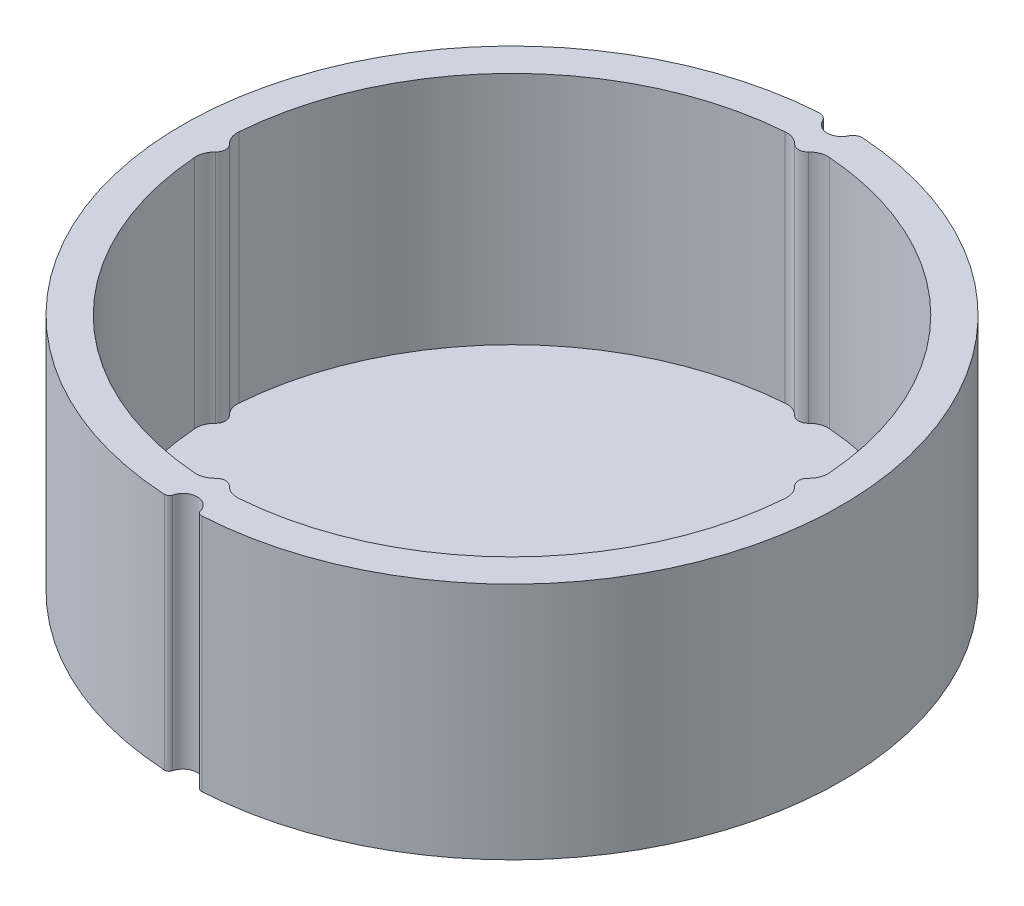
ISO-10303-21;
HEADER;
FILE_DESCRIPTION(('STEP AP214'),'2;1');
FILE_NAME('part.step','',(''),(''),'','','');
FILE_SCHEMA(('AUTOMOTIVE_DESIGN { 1 0 10303 214 1 1 1 1 }'));
ENDSEC;
DATA;
#1=APPLICATION_CONTEXT('core data for automotive mechanical design processes');
#2=APPLICATION_PROTOCOL_DEFINITION('international standard','automotive_design',2000,#1);
#3=PRODUCT_CONTEXT('',#1,'mechanical');
#4=PRODUCT('Part','Part','',(#3));
#5=PRODUCT_RELATED_PRODUCT_CATEGORY('part','',(#4));
#6=PRODUCT_DEFINITION_FORMATION('','',#4);
#7=PRODUCT_DEFINITION_CONTEXT('part definition',#1,'design');
#8=PRODUCT_DEFINITION('design','',#6,#7);
#9=PRODUCT_DEFINITION_SHAPE('','',#8);
#10=(LENGTH_UNIT() NAMED_UNIT(*) SI_UNIT(.MILLI.,.METRE.));
#11=(NAMED_UNIT(*) PLANE_ANGLE_UNIT() SI_UNIT($,.RADIAN.));
#12=(NAMED_UNIT(*) SI_UNIT($,.STERADIAN.) SOLID_ANGLE_UNIT());
#13=UNCERTAINTY_MEASURE_WITH_UNIT(LENGTH_MEASURE(1.E-05),#10,'distance_accuracy_value','');
#14=(GEOMETRIC_REPRESENTATION_CONTEXT(3) GLOBAL_UNCERTAINTY_ASSIGNED_CONTEXT((#13)) GLOBAL_UNIT_ASSIGNED_CONTEXT((#10,
#11,#12)) REPRESENTATION_CONTEXT('',''));
#15=CARTESIAN_POINT('',(0.,0.,0.));
#16=DIRECTION('',(0.,0.,1.));
#17=DIRECTION('',(1.,0.,0.));
#18=AXIS2_PLACEMENT_3D('',#15,#16,#17);
#19=CARTESIAN_POINT('',(0.,25.,0.));
#20=DIRECTION('',(0.,1.,0.));
#21=DIRECTION('',(0.,0.,1.));
#22=AXIS2_PLACEMENT_3D('',#19,#20,#21);
#23=PLANE('',#22);
#24=CARTESIAN_POINT('',(-1.93575856721061,25.,33.9428491683965));
#25=DIRECTION('',(0.,1.,0.));
#26=DIRECTION('',(0.,0.,1.));
#27=AXIS2_PLACEMENT_3D('',#24,#25,#26);
#28=CIRCLE('',#27,0.500000000000003);
#29=CARTESIAN_POINT('',(-1.45181892540796,25.,34.0685568574689));
#30=VERTEX_POINT('',#29);
#31=CARTESIAN_POINT('',(-1.96422560496371,25.,34.4420381383884));
#32=VERTEX_POINT('',#31);
#33=EDGE_CURVE('E338',#30,#32,#28,.F.);
#34=ORIENTED_EDGE('',*,*,#33,.F.);
#35=CARTESIAN_POINT('',(0.,25.,34.4456799246862));
#36=DIRECTION('',(0.,1.,0.));
#37=DIRECTION('',(0.,0.,1.));
#38=AXIS2_PLACEMENT_3D('',#35,#36,#37);
#39=CIRCLE('',#38,1.50000000000002);
#40=CARTESIAN_POINT('',(1.45181892540796,25.,34.0685568574689));
#41=VERTEX_POINT('',#40);
#42=EDGE_CURVE('E342',#41,#30,#39,.T.);
#43=ORIENTED_EDGE('',*,*,#42,.F.);
#44=CARTESIAN_POINT('',(1.93575856721061,25.,33.9428491683965));
#45=DIRECTION('',(0.,1.,0.));
#46=DIRECTION('',(0.,0.,1.));
#47=AXIS2_PLACEMENT_3D('',#44,#45,#46);
#48=CIRCLE('',#47,0.500000000000003);
#49=CARTESIAN_POINT('',(1.9642256049637,25.,34.4420381383884));
#50=VERTEX_POINT('',#49);
#51=EDGE_CURVE('E347',#41,#50,#48,.T.);
#52=ORIENTED_EDGE('',*,*,#51,.T.);
#53=CARTESIAN_POINT('',(0.,25.,-0.0020007910519898));
#54=DIRECTION('',(0.,1.,0.));
#55=DIRECTION('',(0.,0.,1.));
#56=AXIS2_PLACEMENT_3D('',#53,#54,#55);
#57=CIRCLE('',#56,34.5);
#58=CARTESIAN_POINT('',(2.32413582105506,25.,-34.4236276074198));
#59=VERTEX_POINT('',#58);
#60=EDGE_CURVE('E350',#50,#59,#57,.T.);
#61=ORIENTED_EDGE('',*,*,#60,.T.);
#62=CARTESIAN_POINT('',(2.2567695653723,25.,-33.4258992939019));
#63=DIRECTION('',(0.,1.,0.));
#64=DIRECTION('',(0.,0.,1.));
#65=AXIS2_PLACEMENT_3D('',#62,#63,#64);
#66=CIRCLE('',#65,1.);
#67=CARTESIAN_POINT('',(1.35406173922335,25.,-33.8561533823304));
#68=VERTEX_POINT('',#67);
#69=EDGE_CURVE('E353',#68,#59,#66,.F.);
#70=ORIENTED_EDGE('',*,*,#69,.F.);
#71=CARTESIAN_POINT('',(0.,25.,-34.5015345149731));
#72=DIRECTION('',(0.,1.,0.));
#73=DIRECTION('',(0.,0.,1.));
#74=AXIS2_PLACEMENT_3D('',#71,#72,#73);
#75=CIRCLE('',#74,1.49999999999991);
#76=CARTESIAN_POINT('',(-1.35406173922335,25.,-33.8561533823304));
#77=VERTEX_POINT('',#76);
#78=EDGE_CURVE('E357',#77,#68,#75,.T.);
#79=ORIENTED_EDGE('',*,*,#78,.F.);
#80=CARTESIAN_POINT('',(-2.2567695653723,25.,-33.4258992939019));
#81=DIRECTION('',(0.,1.,0.));
#82=DIRECTION('',(0.,0.,1.));
#83=AXIS2_PLACEMENT_3D('',#80,#81,#82);
#84=CIRCLE('',#83,1.);
#85=CARTESIAN_POINT('',(-2.32413582105505,25.,-34.4236276074198));
#86=VERTEX_POINT('',#85);
#87=EDGE_CURVE('E361',#77,#86,#84,.T.);
#88=ORIENTED_EDGE('',*,*,#87,.T.);
#89=CARTESIAN_POINT('',(0.,25.,-0.0020007910519898));
#90=DIRECTION('',(0.,1.,0.));
#91=DIRECTION('',(0.,0.,1.));
#92=AXIS2_PLACEMENT_3D('',#89,#90,#91);
#93=CIRCLE('',#92,34.5);
#94=EDGE_CURVE('E364',#86,#32,#93,.T.);
#95=ORIENTED_EDGE('',*,*,#94,.T.);
#96=EDGE_LOOP('',(#34,#43,#52,#61,#70,#79,#88,#95));
#97=FACE_BOUND('',#96,.T.);
#98=CARTESIAN_POINT('',(0.,25.,0.));
#99=DIRECTION('',(0.,1.,0.));
#100=DIRECTION('',(0.,0.,1.));
#101=AXIS2_PLACEMENT_3D('',#98,#99,#100);
#102=CIRCLE('',#101,31.);
#103=CARTESIAN_POINT('',(-30.9137931034483,25.,2.31028049318558));
#104=VERTEX_POINT('',#103);
#105=CARTESIAN_POINT('',(-2.31028049318558,25.,30.9137931034483));
#106=VERTEX_POINT('',#105);
#107=EDGE_CURVE('E233',#104,#106,#102,.T.);
#108=ORIENTED_EDGE('',*,*,#107,.F.);
#109=CARTESIAN_POINT('',(-28.9193548387097,25.,2.16123013878651));
#110=DIRECTION('',(0.,1.,0.));
#111=DIRECTION('',(0.,0.,1.));
#112=AXIS2_PLACEMENT_3D('',#109,#110,#111);
#113=CIRCLE('',#112,2.);
#114=CARTESIAN_POINT('',(-30.3064516129032,25.,0.720410046262172));
#115=VERTEX_POINT('',#114);
#116=EDGE_CURVE('E229',#115,#104,#113,.T.);
#117=ORIENTED_EDGE('',*,*,#116,.F.);
#118=CARTESIAN_POINT('',(-31.,25.,0.));
#119=DIRECTION('',(0.,-1.,0.));
#120=DIRECTION('',(0.,0.,1.));
#121=AXIS2_PLACEMENT_3D('',#118,#119,#120);
#122=CIRCLE('',#121,1.);
#123=CARTESIAN_POINT('',(-30.3064516129032,25.,-0.720410046262172));
#124=VERTEX_POINT('',#123);
#125=EDGE_CURVE('E211',#124,#115,#122,.T.);
#126=ORIENTED_EDGE('',*,*,#125,.F.);
#127=CARTESIAN_POINT('',(-28.9193548387097,25.,-2.16123013878651));
#128=DIRECTION('',(0.,1.,0.));
#129=DIRECTION('',(0.,0.,-1.));
#130=AXIS2_PLACEMENT_3D('',#127,#128,#129);
#131=CIRCLE('',#130,2.);
#132=CARTESIAN_POINT('',(-30.9137931034483,25.,-2.31028049318558));
#133=VERTEX_POINT('',#132);
#134=EDGE_CURVE('E277',#133,#124,#131,.T.);
#135=ORIENTED_EDGE('',*,*,#134,.F.);
#136=CARTESIAN_POINT('',(0.,25.,0.));
#137=DIRECTION('',(0.,1.,0.));
#138=DIRECTION('',(0.,0.,1.));
#139=AXIS2_PLACEMENT_3D('',#136,#137,#138);
#140=CIRCLE('',#139,31.);
#141=CARTESIAN_POINT('',(-2.31028049318557,25.,-30.9137931034483));
#142=VERTEX_POINT('',#141);
#143=EDGE_CURVE('E274',#142,#133,#140,.T.);
#144=ORIENTED_EDGE('',*,*,#143,.F.);
#145=CARTESIAN_POINT('',(-2.16123013878651,25.,-28.9193548387097));
#146=DIRECTION('',(0.,1.,0.));
#147=DIRECTION('',(0.,0.,1.));
#148=AXIS2_PLACEMENT_3D('',#145,#146,#147);
#149=CIRCLE('',#148,2.);
#150=CARTESIAN_POINT('',(-0.720410046262171,25.,-30.3064516129032));
#151=VERTEX_POINT('',#150);
#152=EDGE_CURVE('E271',#151,#142,#149,.T.);
#153=ORIENTED_EDGE('',*,*,#152,.F.);
#154=CARTESIAN_POINT('',(0.,25.,-31.));
#155=DIRECTION('',(0.,-1.,0.));
#156=DIRECTION('',(0.,0.,1.));
#157=AXIS2_PLACEMENT_3D('',#154,#155,#156);
#158=CIRCLE('',#157,1.);
#159=CARTESIAN_POINT('',(0.720410046262172,25.,-30.3064516129032));
#160=VERTEX_POINT('',#159);
#161=EDGE_CURVE('E268',#160,#151,#158,.T.);
#162=ORIENTED_EDGE('',*,*,#161,.F.);
#163=CARTESIAN_POINT('',(2.16123013878651,25.,-28.9193548387097));
#164=DIRECTION('',(0.,1.,0.));
#165=DIRECTION('',(0.,0.,-1.));
#166=AXIS2_PLACEMENT_3D('',#163,#164,#165);
#167=CIRCLE('',#166,2.);
#168=CARTESIAN_POINT('',(2.31028049318558,25.,-30.9137931034483));
#169=VERTEX_POINT('',#168);
#170=EDGE_CURVE('E265',#169,#160,#167,.T.);
#171=ORIENTED_EDGE('',*,*,#170,.F.);
#172=CARTESIAN_POINT('',(0.,25.,0.));
#173=DIRECTION('',(0.,1.,0.));
#174=DIRECTION('',(0.,0.,1.));
#175=AXIS2_PLACEMENT_3D('',#172,#173,#174);
#176=CIRCLE('',#175,31.);
#177=CARTESIAN_POINT('',(30.9137931034483,25.,-2.31028049318559));
#178=VERTEX_POINT('',#177);
#179=EDGE_CURVE('E262',#178,#169,#176,.T.);
#180=ORIENTED_EDGE('',*,*,#179,.F.);
#181=CARTESIAN_POINT('',(28.9193548387097,25.,-2.16123013878651));
#182=DIRECTION('',(0.,1.,0.));
#183=DIRECTION('',(0.,0.,1.));
#184=AXIS2_PLACEMENT_3D('',#181,#182,#183);
#185=CIRCLE('',#184,2.);
#186=CARTESIAN_POINT('',(30.3064516129032,25.,-0.720410046262172));
#187=VERTEX_POINT('',#186);
#188=EDGE_CURVE('E259',#187,#178,#185,.T.);
#189=ORIENTED_EDGE('',*,*,#188,.F.);
#190=CARTESIAN_POINT('',(31.,25.,0.));
#191=DIRECTION('',(0.,-1.,0.));
#192=DIRECTION('',(0.,0.,1.));
#193=AXIS2_PLACEMENT_3D('',#190,#191,#192);
#194=CIRCLE('',#193,1.);
#195=CARTESIAN_POINT('',(30.3064516129032,25.,0.720410046262172));
#196=VERTEX_POINT('',#195);
#197=EDGE_CURVE('E256',#196,#187,#194,.T.);
#198=ORIENTED_EDGE('',*,*,#197,.F.);
#199=CARTESIAN_POINT('',(28.9193548387097,25.,2.16123013878651));
#200=DIRECTION('',(0.,1.,0.));
#201=DIRECTION('',(0.,0.,-1.));
#202=AXIS2_PLACEMENT_3D('',#199,#200,#201);
#203=CIRCLE('',#202,2.);
#204=CARTESIAN_POINT('',(30.9137931034483,25.,2.31028049318558));
#205=VERTEX_POINT('',#204);
#206=EDGE_CURVE('E253',#205,#196,#203,.T.);
#207=ORIENTED_EDGE('',*,*,#206,.F.);
#208=CARTESIAN_POINT('',(0.,25.,0.));
#209=DIRECTION('',(0.,1.,0.));
#210=DIRECTION('',(0.,0.,1.));
#211=AXIS2_PLACEMENT_3D('',#208,#209,#210);
#212=CIRCLE('',#211,31.);
#213=CARTESIAN_POINT('',(2.31028049318558,25.,30.9137931034483));
#214=VERTEX_POINT('',#213);
#215=EDGE_CURVE('E250',#214,#205,#212,.T.);
#216=ORIENTED_EDGE('',*,*,#215,.F.);
#217=CARTESIAN_POINT('',(2.16123013878651,25.,28.9193548387097));
#218=DIRECTION('',(0.,1.,0.));
#219=DIRECTION('',(0.,0.,1.));
#220=AXIS2_PLACEMENT_3D('',#217,#218,#219);
#221=CIRCLE('',#220,2.);
#222=CARTESIAN_POINT('',(0.720410046262172,25.,30.3064516129032));
#223=VERTEX_POINT('',#222);
#224=EDGE_CURVE('E247',#223,#214,#221,.T.);
#225=ORIENTED_EDGE('',*,*,#224,.F.);
#226=CARTESIAN_POINT('',(0.,25.,31.));
#227=DIRECTION('',(0.,-1.,0.));
#228=DIRECTION('',(0.,0.,1.));
#229=AXIS2_PLACEMENT_3D('',#226,#227,#228);
#230=CIRCLE('',#229,1.);
#231=CARTESIAN_POINT('',(-0.720410046262172,25.,30.3064516129032));
#232=VERTEX_POINT('',#231);
#233=EDGE_CURVE('E244',#232,#223,#230,.T.);
#234=ORIENTED_EDGE('',*,*,#233,.F.);
#235=CARTESIAN_POINT('',(-2.16123013878651,25.,28.9193548387097));
#236=DIRECTION('',(0.,1.,0.));
#237=DIRECTION('',(0.,0.,-1.));
#238=AXIS2_PLACEMENT_3D('',#235,#236,#237);
#239=CIRCLE('',#238,2.);
#240=EDGE_CURVE('E241',#106,#232,#239,.T.);
#241=ORIENTED_EDGE('',*,*,#240,.F.);
#242=EDGE_LOOP('',(#108,#117,#126,#135,#144,#153,#162,#171,#180,#189,#198,#207,#216,#225,#234,#241));
#243=FACE_BOUND('',#242,.T.);
#244=ADVANCED_FACE('F41',(#97,#243),#23,.T.);
#245=CARTESIAN_POINT('',(0.,0.,0.));
#246=DIRECTION('',(0.,1.,0.));
#247=DIRECTION('',(0.,0.,1.));
#248=AXIS2_PLACEMENT_3D('',#245,#246,#247);
#249=PLANE('',#248);
#250=CARTESIAN_POINT('',(-1.93575856721061,0.,33.9428491683965));
#251=DIRECTION('',(0.,1.,0.));
#252=DIRECTION('',(0.,0.,1.));
#253=AXIS2_PLACEMENT_3D('',#250,#251,#252);
#254=CIRCLE('',#253,0.500000000000003);
#255=CARTESIAN_POINT('',(-1.45181892540796,0.,34.0685568574689));
#256=VERTEX_POINT('',#255);
#257=CARTESIAN_POINT('',(-1.96422560496371,0.,34.4420381383884));
#258=VERTEX_POINT('',#257);
#259=EDGE_CURVE('E337',#256,#258,#254,.F.);
#260=ORIENTED_EDGE('',*,*,#259,.T.);
#261=CARTESIAN_POINT('',(0.,0.,-0.0020007910519898));
#262=DIRECTION('',(0.,1.,0.));
#263=DIRECTION('',(0.,0.,1.));
#264=AXIS2_PLACEMENT_3D('',#261,#262,#263);
#265=CIRCLE('',#264,34.5);
#266=CARTESIAN_POINT('',(-2.32413582105505,0.,-34.4236276074198));
#267=VERTEX_POINT('',#266);
#268=EDGE_CURVE('E343',#267,#258,#265,.T.);
#269=ORIENTED_EDGE('',*,*,#268,.F.);
#270=CARTESIAN_POINT('',(-2.2567695653723,0.,-33.4258992939019));
#271=DIRECTION('',(0.,1.,0.));
#272=DIRECTION('',(0.,0.,1.));
#273=AXIS2_PLACEMENT_3D('',#270,#271,#272);
#274=CIRCLE('',#273,1.);
#275=CARTESIAN_POINT('',(-1.35406173922335,0.,-33.8561533823304));
#276=VERTEX_POINT('',#275);
#277=EDGE_CURVE('E390',#276,#267,#274,.T.);
#278=ORIENTED_EDGE('',*,*,#277,.F.);
#279=CARTESIAN_POINT('',(0.,0.,-34.5015345149731));
#280=DIRECTION('',(0.,1.,0.));
#281=DIRECTION('',(0.,0.,1.));
#282=AXIS2_PLACEMENT_3D('',#279,#280,#281);
#283=CIRCLE('',#282,1.49999999999991);
#284=CARTESIAN_POINT('',(1.35406173922335,0.,-33.8561533823304));
#285=VERTEX_POINT('',#284);
#286=EDGE_CURVE('E386',#276,#285,#283,.T.);
#287=ORIENTED_EDGE('',*,*,#286,.T.);
#288=CARTESIAN_POINT('',(2.2567695653723,0.,-33.4258992939019));
#289=DIRECTION('',(0.,1.,0.));
#290=DIRECTION('',(0.,0.,1.));
#291=AXIS2_PLACEMENT_3D('',#288,#289,#290);
#292=CIRCLE('',#291,1.);
#293=CARTESIAN_POINT('',(2.32413582105506,0.,-34.4236276074198));
#294=VERTEX_POINT('',#293);
#295=EDGE_CURVE('E382',#285,#294,#292,.F.);
#296=ORIENTED_EDGE('',*,*,#295,.T.);
#297=CARTESIAN_POINT('',(0.,0.,-0.0020007910519898));
#298=DIRECTION('',(0.,1.,0.));
#299=DIRECTION('',(0.,0.,1.));
#300=AXIS2_PLACEMENT_3D('',#297,#298,#299);
#301=CIRCLE('',#300,34.5);
#302=CARTESIAN_POINT('',(1.9642256049637,0.,34.4420381383884));
#303=VERTEX_POINT('',#302);
#304=EDGE_CURVE('E378',#303,#294,#301,.T.);
#305=ORIENTED_EDGE('',*,*,#304,.F.);
#306=CARTESIAN_POINT('',(1.93575856721061,0.,33.9428491683965));
#307=DIRECTION('',(0.,1.,0.));
#308=DIRECTION('',(0.,0.,1.));
#309=AXIS2_PLACEMENT_3D('',#306,#307,#308);
#310=CIRCLE('',#309,0.500000000000003);
#311=CARTESIAN_POINT('',(1.45181892540796,0.,34.0685568574689));
#312=VERTEX_POINT('',#311);
#313=EDGE_CURVE('E375',#312,#303,#310,.T.);
#314=ORIENTED_EDGE('',*,*,#313,.F.);
#315=CARTESIAN_POINT('',(0.,0.,34.4456799246862));
#316=DIRECTION('',(0.,1.,0.));
#317=DIRECTION('',(0.,0.,1.));
#318=AXIS2_PLACEMENT_3D('',#315,#316,#317);
#319=CIRCLE('',#318,1.50000000000002);
#320=EDGE_CURVE('E371',#312,#256,#319,.T.);
#321=ORIENTED_EDGE('',*,*,#320,.T.);
#322=EDGE_LOOP('',(#260,#269,#278,#287,#296,#305,#314,#321));
#323=FACE_BOUND('',#322,.T.);
#324=ADVANCED_FACE('F425',(#323),#249,.F.);
#325=CARTESIAN_POINT('',(-1.93575856721061,25.,33.9428491683965));
#326=DIRECTION('',(0.,-1.,0.));
#327=DIRECTION('',(0.,0.,-1.));
#328=AXIS2_PLACEMENT_3D('',#325,#326,#327);
#329=CYLINDRICAL_SURFACE('',#328,0.500000000000003);
#330=ORIENTED_EDGE('',*,*,#259,.F.);
#331=DIRECTION('',(0.,-1.,0.));
#332=VECTOR('',#331,1.);
#333=CARTESIAN_POINT('',(-1.45181892540796,25.,34.0685568574689));
#334=LINE('',#333,#332);
#335=EDGE_CURVE('E11',#30,#256,#334,.T.);
#336=ORIENTED_EDGE('',*,*,#335,.F.);
#337=ORIENTED_EDGE('',*,*,#33,.T.);
#338=DIRECTION('',(0.,-1.,0.));
#339=VECTOR('',#338,1.);
#340=CARTESIAN_POINT('',(-1.96422560496371,25.,34.4420381383884));
#341=LINE('',#340,#339);
#342=EDGE_CURVE('E367',#32,#258,#341,.T.);
#343=ORIENTED_EDGE('',*,*,#342,.T.);
#344=EDGE_LOOP('',(#330,#336,#337,#343));
#345=FACE_BOUND('',#344,.T.);
#346=ADVANCED_FACE('F43',(#345),#329,.T.);
#347=CARTESIAN_POINT('',(0.,25.,34.4456799246862));
#348=DIRECTION('',(0.,-1.,0.));
#349=DIRECTION('',(0.,0.,-1.));
#350=AXIS2_PLACEMENT_3D('',#347,#348,#349);
#351=CYLINDRICAL_SURFACE('',#350,1.50000000000002);
#352=ORIENTED_EDGE('',*,*,#320,.F.);
#353=DIRECTION('',(0.,-1.,0.));
#354=VECTOR('',#353,1.);
#355=CARTESIAN_POINT('',(1.45181892540796,25.,34.0685568574689));
#356=LINE('',#355,#354);
#357=EDGE_CURVE('E50',#41,#312,#356,.T.);
#358=ORIENTED_EDGE('',*,*,#357,.F.);
#359=ORIENTED_EDGE('',*,*,#42,.T.);
#360=ORIENTED_EDGE('',*,*,#335,.T.);
#361=EDGE_LOOP('',(#352,#358,#359,#360));
#362=FACE_BOUND('',#361,.T.);
#363=ADVANCED_FACE('F426',(#362),#351,.F.);
#364=CARTESIAN_POINT('',(1.93575856721061,25.,33.9428491683965));
#365=DIRECTION('',(0.,-1.,0.));
#366=DIRECTION('',(0.,0.,-1.));
#367=AXIS2_PLACEMENT_3D('',#364,#365,#366);
#368=CYLINDRICAL_SURFACE('',#367,0.500000000000003);
#369=ORIENTED_EDGE('',*,*,#313,.T.);
#370=DIRECTION('',(0.,-1.,0.));
#371=VECTOR('',#370,1.);
#372=CARTESIAN_POINT('',(1.9642256049637,25.,34.4420381383884));
#373=LINE('',#372,#371);
#374=EDGE_CURVE('E411',#50,#303,#373,.T.);
#375=ORIENTED_EDGE('',*,*,#374,.F.);
#376=ORIENTED_EDGE('',*,*,#51,.F.);
#377=ORIENTED_EDGE('',*,*,#357,.T.);
#378=EDGE_LOOP('',(#369,#375,#376,#377));
#379=FACE_BOUND('',#378,.T.);
#380=ADVANCED_FACE('F418',(#379),#368,.T.);
#381=CARTESIAN_POINT('',(0.,25.,-0.0020007910519898));
#382=DIRECTION('',(0.,-1.,0.));
#383=DIRECTION('',(0.,0.,-1.));
#384=AXIS2_PLACEMENT_3D('',#381,#382,#383);
#385=CYLINDRICAL_SURFACE('',#384,34.5);
#386=ORIENTED_EDGE('',*,*,#304,.T.);
#387=DIRECTION('',(0.,-1.,0.));
#388=VECTOR('',#387,1.);
#389=CARTESIAN_POINT('',(2.32413582105506,25.,-34.4236276074198));
#390=LINE('',#389,#388);
#391=EDGE_CURVE('E408',#59,#294,#390,.T.);
#392=ORIENTED_EDGE('',*,*,#391,.F.);
#393=ORIENTED_EDGE('',*,*,#60,.F.);
#394=ORIENTED_EDGE('',*,*,#374,.T.);
#395=EDGE_LOOP('',(#386,#392,#393,#394));
#396=FACE_BOUND('',#395,.T.);
#397=ADVANCED_FACE('F451',(#396),#385,.T.);
#398=CARTESIAN_POINT('',(2.2567695653723,25.,-33.4258992939019));
#399=DIRECTION('',(0.,-1.,0.));
#400=DIRECTION('',(0.,0.,-1.));
#401=AXIS2_PLACEMENT_3D('',#398,#399,#400);
#402=CYLINDRICAL_SURFACE('',#401,1.);
#403=ORIENTED_EDGE('',*,*,#295,.F.);
#404=DIRECTION('',(0.,-1.,0.));
#405=VECTOR('',#404,1.);
#406=CARTESIAN_POINT('',(1.35406173922335,25.,-33.8561533823304));
#407=LINE('',#406,#405);
#408=EDGE_CURVE('E405',#68,#285,#407,.T.);
#409=ORIENTED_EDGE('',*,*,#408,.F.);
#410=ORIENTED_EDGE('',*,*,#69,.T.);
#411=ORIENTED_EDGE('',*,*,#391,.T.);
#412=EDGE_LOOP('',(#403,#409,#410,#411));
#413=FACE_BOUND('',#412,.T.);
#414=ADVANCED_FACE('F446',(#413),#402,.T.);
#415=CARTESIAN_POINT('',(0.,25.,-34.5015345149731));
#416=DIRECTION('',(0.,-1.,0.));
#417=DIRECTION('',(0.,0.,-1.));
#418=AXIS2_PLACEMENT_3D('',#415,#416,#417);
#419=CYLINDRICAL_SURFACE('',#418,1.49999999999991);
#420=ORIENTED_EDGE('',*,*,#286,.F.);
#421=DIRECTION('',(0.,-1.,0.));
#422=VECTOR('',#421,1.);
#423=CARTESIAN_POINT('',(-1.35406173922335,25.,-33.8561533823304));
#424=LINE('',#423,#422);
#425=EDGE_CURVE('E402',#77,#276,#424,.T.);
#426=ORIENTED_EDGE('',*,*,#425,.F.);
#427=ORIENTED_EDGE('',*,*,#78,.T.);
#428=ORIENTED_EDGE('',*,*,#408,.T.);
#429=EDGE_LOOP('',(#420,#426,#427,#428));
#430=FACE_BOUND('',#429,.T.);
#431=ADVANCED_FACE('F443',(#430),#419,.F.);
#432=CARTESIAN_POINT('',(-2.2567695653723,25.,-33.4258992939019));
#433=DIRECTION('',(0.,-1.,0.));
#434=DIRECTION('',(0.,0.,-1.));
#435=AXIS2_PLACEMENT_3D('',#432,#433,#434);
#436=CYLINDRICAL_SURFACE('',#435,1.);
#437=ORIENTED_EDGE('',*,*,#277,.T.);
#438=DIRECTION('',(0.,-1.,0.));
#439=VECTOR('',#438,1.);
#440=CARTESIAN_POINT('',(-2.32413582105505,25.,-34.4236276074198));
#441=LINE('',#440,#439);
#442=EDGE_CURVE('E398',#86,#267,#441,.T.);
#443=ORIENTED_EDGE('',*,*,#442,.F.);
#444=ORIENTED_EDGE('',*,*,#87,.F.);
#445=ORIENTED_EDGE('',*,*,#425,.T.);
#446=EDGE_LOOP('',(#437,#443,#444,#445));
#447=FACE_BOUND('',#446,.T.);
#448=ADVANCED_FACE('F440',(#447),#436,.T.);
#449=CARTESIAN_POINT('',(0.,25.,-0.0020007910519898));
#450=DIRECTION('',(0.,-1.,0.));
#451=DIRECTION('',(0.,0.,-1.));
#452=AXIS2_PLACEMENT_3D('',#449,#450,#451);
#453=CYLINDRICAL_SURFACE('',#452,34.5);
#454=ORIENTED_EDGE('',*,*,#268,.T.);
#455=ORIENTED_EDGE('',*,*,#342,.F.);
#456=ORIENTED_EDGE('',*,*,#94,.F.);
#457=ORIENTED_EDGE('',*,*,#442,.T.);
#458=EDGE_LOOP('',(#454,#455,#456,#457));
#459=FACE_BOUND('',#458,.T.);
#460=ADVANCED_FACE('F435',(#459),#453,.T.);
#461=CARTESIAN_POINT('',(-28.9193548387097,25.,2.16123013878651));
#462=DIRECTION('',(0.,-1.,0.));
#463=DIRECTION('',(0.,0.,-1.));
#464=AXIS2_PLACEMENT_3D('',#461,#462,#463);
#465=CYLINDRICAL_SURFACE('',#464,2.);
#466=CARTESIAN_POINT('',(-28.9193548387097,0.4,2.16123013878651));
#467=DIRECTION('',(0.,1.,0.));
#468=DIRECTION('',(0.,0.,1.));
#469=AXIS2_PLACEMENT_3D('',#466,#467,#468);
#470=CIRCLE('',#469,2.);
#471=CARTESIAN_POINT('',(-30.3064516129032,0.4,0.720410046262172));
#472=VERTEX_POINT('',#471);
#473=CARTESIAN_POINT('',(-30.9137931034483,0.400000000000001,2.31028049318558));
#474=VERTEX_POINT('',#473);
#475=EDGE_CURVE('E218',#472,#474,#470,.T.);
#476=ORIENTED_EDGE('',*,*,#475,.F.);
#477=DIRECTION('',(0.,-1.,0.));
#478=VECTOR('',#477,1.);
#479=CARTESIAN_POINT('',(-30.3064516129032,25.,0.720410046262172));
#480=LINE('',#479,#478);
#481=EDGE_CURVE('E204',#115,#472,#480,.T.);
#482=ORIENTED_EDGE('',*,*,#481,.F.);
#483=ORIENTED_EDGE('',*,*,#116,.T.);
#484=DIRECTION('',(0.,-1.,0.));
#485=VECTOR('',#484,1.);
#486=CARTESIAN_POINT('',(-30.9137931034483,25.,2.31028049318558));
#487=LINE('',#486,#485);
#488=EDGE_CURVE('E220',#104,#474,#487,.T.);
#489=ORIENTED_EDGE('',*,*,#488,.T.);
#490=EDGE_LOOP('',(#476,#482,#483,#489));
#491=FACE_BOUND('',#490,.T.);
#492=ADVANCED_FACE('F219',(#491),#465,.F.);
#493=CARTESIAN_POINT('',(0.,25.,0.));
#494=DIRECTION('',(0.,-1.,0.));
#495=DIRECTION('',(0.,0.,-1.));
#496=AXIS2_PLACEMENT_3D('',#493,#494,#495);
#497=CYLINDRICAL_SURFACE('',#496,31.);
#498=CARTESIAN_POINT('',(0.,0.4,0.));
#499=DIRECTION('',(0.,1.,0.));
#500=DIRECTION('',(0.,0.,1.));
#501=AXIS2_PLACEMENT_3D('',#498,#499,#500);
#502=CIRCLE('',#501,31.);
#503=CARTESIAN_POINT('',(-2.31028049318558,0.400000000000001,30.9137931034483));
#504=VERTEX_POINT('',#503);
#505=EDGE_CURVE('E57',#474,#504,#502,.T.);
#506=ORIENTED_EDGE('',*,*,#505,.F.);
#507=ORIENTED_EDGE('',*,*,#488,.F.);
#508=ORIENTED_EDGE('',*,*,#107,.T.);
#509=DIRECTION('',(0.,-1.,0.));
#510=VECTOR('',#509,1.);
#511=CARTESIAN_POINT('',(-2.31028049318558,25.,30.9137931034483));
#512=LINE('',#511,#510);
#513=EDGE_CURVE('E332',#106,#504,#512,.T.);
#514=ORIENTED_EDGE('',*,*,#513,.T.);
#515=EDGE_LOOP('',(#506,#507,#508,#514));
#516=FACE_BOUND('',#515,.T.);
#517=ADVANCED_FACE('F459',(#516),#497,.F.);
#518=CARTESIAN_POINT('',(-2.16123013878651,25.,28.9193548387097));
#519=DIRECTION('',(0.,-1.,0.));
#520=DIRECTION('',(0.,0.,-1.));
#521=AXIS2_PLACEMENT_3D('',#518,#519,#520);
#522=CYLINDRICAL_SURFACE('',#521,2.);
#523=CARTESIAN_POINT('',(-2.16123013878651,0.4,28.9193548387097));
#524=DIRECTION('',(0.,1.,0.));
#525=DIRECTION('',(0.,0.,-1.));
#526=AXIS2_PLACEMENT_3D('',#523,#524,#525);
#527=CIRCLE('',#526,2.);
#528=CARTESIAN_POINT('',(-0.720410046262172,0.400000000000001,30.3064516129032));
#529=VERTEX_POINT('',#528);
#530=EDGE_CURVE('E65',#504,#529,#527,.T.);
#531=ORIENTED_EDGE('',*,*,#530,.F.);
#532=ORIENTED_EDGE('',*,*,#513,.F.);
#533=ORIENTED_EDGE('',*,*,#240,.T.);
#534=DIRECTION('',(0.,-1.,0.));
#535=VECTOR('',#534,1.);
#536=CARTESIAN_POINT('',(-0.720410046262172,25.,30.3064516129032));
#537=LINE('',#536,#535);
#538=EDGE_CURVE('E329',#232,#529,#537,.T.);
#539=ORIENTED_EDGE('',*,*,#538,.T.);
#540=EDGE_LOOP('',(#531,#532,#533,#539));
#541=FACE_BOUND('',#540,.T.);
#542=ADVANCED_FACE('F460',(#541),#522,.F.);
#543=CARTESIAN_POINT('',(0.,25.,31.));
#544=DIRECTION('',(0.,-1.,0.));
#545=DIRECTION('',(0.,0.,-1.));
#546=AXIS2_PLACEMENT_3D('',#543,#544,#545);
#547=CYLINDRICAL_SURFACE('',#546,1.);
#548=CARTESIAN_POINT('',(0.,0.4,31.));
#549=DIRECTION('',(0.,-1.,0.));
#550=DIRECTION('',(0.,0.,1.));
#551=AXIS2_PLACEMENT_3D('',#548,#549,#550);
#552=CIRCLE('',#551,1.);
#553=CARTESIAN_POINT('',(0.720410046262172,0.400000000000001,30.3064516129032));
#554=VERTEX_POINT('',#553);
#555=EDGE_CURVE('E466',#529,#554,#552,.T.);
#556=ORIENTED_EDGE('',*,*,#555,.F.);
#557=ORIENTED_EDGE('',*,*,#538,.F.);
#558=ORIENTED_EDGE('',*,*,#233,.T.);
#559=DIRECTION('',(0.,-1.,0.));
#560=VECTOR('',#559,1.);
#561=CARTESIAN_POINT('',(0.720410046262172,25.,30.3064516129032));
#562=LINE('',#561,#560);
#563=EDGE_CURVE('E325',#223,#554,#562,.T.);
#564=ORIENTED_EDGE('',*,*,#563,.T.);
#565=EDGE_LOOP('',(#556,#557,#558,#564));
#566=FACE_BOUND('',#565,.T.);
#567=ADVANCED_FACE('F463',(#566),#547,.T.);
#568=CARTESIAN_POINT('',(2.16123013878651,25.,28.9193548387097));
#569=DIRECTION('',(0.,-1.,0.));
#570=DIRECTION('',(0.,0.,-1.));
#571=AXIS2_PLACEMENT_3D('',#568,#569,#570);
#572=CYLINDRICAL_SURFACE('',#571,2.);
#573=CARTESIAN_POINT('',(2.16123013878651,0.4,28.9193548387097));
#574=DIRECTION('',(0.,1.,0.));
#575=DIRECTION('',(0.,0.,1.));
#576=AXIS2_PLACEMENT_3D('',#573,#574,#575);
#577=CIRCLE('',#576,2.);
#578=CARTESIAN_POINT('',(2.31028049318558,0.400000000000001,30.9137931034483));
#579=VERTEX_POINT('',#578);
#580=EDGE_CURVE('E482',#554,#579,#577,.T.);
#581=ORIENTED_EDGE('',*,*,#580,.F.);
#582=ORIENTED_EDGE('',*,*,#563,.F.);
#583=ORIENTED_EDGE('',*,*,#224,.T.);
#584=DIRECTION('',(0.,-1.,0.));
#585=VECTOR('',#584,1.);
#586=CARTESIAN_POINT('',(2.31028049318558,25.,30.9137931034483));
#587=LINE('',#586,#585);
#588=EDGE_CURVE('E321',#214,#579,#587,.T.);
#589=ORIENTED_EDGE('',*,*,#588,.T.);
#590=EDGE_LOOP('',(#581,#582,#583,#589));
#591=FACE_BOUND('',#590,.T.);
#592=ADVANCED_FACE('F472',(#591),#572,.F.);
#593=CARTESIAN_POINT('',(0.,25.,0.));
#594=DIRECTION('',(0.,-1.,0.));
#595=DIRECTION('',(0.,0.,-1.));
#596=AXIS2_PLACEMENT_3D('',#593,#594,#595);
#597=CYLINDRICAL_SURFACE('',#596,31.);
#598=CARTESIAN_POINT('',(0.,0.4,0.));
#599=DIRECTION('',(0.,1.,0.));
#600=DIRECTION('',(0.,0.,1.));
#601=AXIS2_PLACEMENT_3D('',#598,#599,#600);
#602=CIRCLE('',#601,31.);
#603=CARTESIAN_POINT('',(30.9137931034483,0.400000000000001,2.31028049318558));
#604=VERTEX_POINT('',#603);
#605=EDGE_CURVE('E478',#579,#604,#602,.T.);
#606=ORIENTED_EDGE('',*,*,#605,.F.);
#607=ORIENTED_EDGE('',*,*,#588,.F.);
#608=ORIENTED_EDGE('',*,*,#215,.T.);
#609=DIRECTION('',(0.,-1.,0.));
#610=VECTOR('',#609,1.);
#611=CARTESIAN_POINT('',(30.9137931034483,25.,2.31028049318558));
#612=LINE('',#611,#610);
#613=EDGE_CURVE('E317',#205,#604,#612,.T.);
#614=ORIENTED_EDGE('',*,*,#613,.T.);
#615=EDGE_LOOP('',(#606,#607,#608,#614));
#616=FACE_BOUND('',#615,.T.);
#617=ADVANCED_FACE('F475',(#616),#597,.F.);
#618=CARTESIAN_POINT('',(28.9193548387097,25.,2.16123013878651));
#619=DIRECTION('',(0.,-1.,0.));
#620=DIRECTION('',(0.,0.,-1.));
#621=AXIS2_PLACEMENT_3D('',#618,#619,#620);
#622=CYLINDRICAL_SURFACE('',#621,2.);
#623=CARTESIAN_POINT('',(28.9193548387097,0.4,2.16123013878651));
#624=DIRECTION('',(0.,1.,0.));
#625=DIRECTION('',(0.,0.,-1.));
#626=AXIS2_PLACEMENT_3D('',#623,#624,#625);
#627=CIRCLE('',#626,2.);
#628=CARTESIAN_POINT('',(30.3064516129032,0.400000000000001,0.720410046262172));
#629=VERTEX_POINT('',#628);
#630=EDGE_CURVE('E481',#604,#629,#627,.T.);
#631=ORIENTED_EDGE('',*,*,#630,.F.);
#632=ORIENTED_EDGE('',*,*,#613,.F.);
#633=ORIENTED_EDGE('',*,*,#206,.T.);
#634=DIRECTION('',(0.,-1.,0.));
#635=VECTOR('',#634,1.);
#636=CARTESIAN_POINT('',(30.3064516129032,25.,0.720410046262172));
#637=LINE('',#636,#635);
#638=EDGE_CURVE('E313',#196,#629,#637,.T.);
#639=ORIENTED_EDGE('',*,*,#638,.T.);
#640=EDGE_LOOP('',(#631,#632,#633,#639));
#641=FACE_BOUND('',#640,.T.);
#642=ADVANCED_FACE('F559',(#641),#622,.F.);
#643=CARTESIAN_POINT('',(31.,25.,0.));
#644=DIRECTION('',(0.,-1.,0.));
#645=DIRECTION('',(0.,0.,-1.));
#646=AXIS2_PLACEMENT_3D('',#643,#644,#645);
#647=CYLINDRICAL_SURFACE('',#646,1.);
#648=CARTESIAN_POINT('',(31.,0.4,0.));
#649=DIRECTION('',(0.,-1.,0.));
#650=DIRECTION('',(0.,0.,1.));
#651=AXIS2_PLACEMENT_3D('',#648,#649,#650);
#652=CIRCLE('',#651,1.);
#653=CARTESIAN_POINT('',(30.3064516129032,0.400000000000001,-0.720410046262172));
#654=VERTEX_POINT('',#653);
#655=EDGE_CURVE('E486',#629,#654,#652,.T.);
#656=ORIENTED_EDGE('',*,*,#655,.F.);
#657=ORIENTED_EDGE('',*,*,#638,.F.);
#658=ORIENTED_EDGE('',*,*,#197,.T.);
#659=DIRECTION('',(0.,-1.,0.));
#660=VECTOR('',#659,1.);
#661=CARTESIAN_POINT('',(30.3064516129032,25.,-0.720410046262172));
#662=LINE('',#661,#660);
#663=EDGE_CURVE('E309',#187,#654,#662,.T.);
#664=ORIENTED_EDGE('',*,*,#663,.T.);
#665=EDGE_LOOP('',(#656,#657,#658,#664));
#666=FACE_BOUND('',#665,.T.);
#667=ADVANCED_FACE('F555',(#666),#647,.T.);
#668=CARTESIAN_POINT('',(28.9193548387097,25.,-2.16123013878651));
#669=DIRECTION('',(0.,-1.,0.));
#670=DIRECTION('',(0.,0.,-1.));
#671=AXIS2_PLACEMENT_3D('',#668,#669,#670);
#672=CYLINDRICAL_SURFACE('',#671,2.);
#673=CARTESIAN_POINT('',(28.9193548387097,0.4,-2.16123013878651));
#674=DIRECTION('',(0.,1.,0.));
#675=DIRECTION('',(0.,0.,1.));
#676=AXIS2_PLACEMENT_3D('',#673,#674,#675);
#677=CIRCLE('',#676,2.);
#678=CARTESIAN_POINT('',(30.9137931034483,0.400000000000001,-2.31028049318559));
#679=VERTEX_POINT('',#678);
#680=EDGE_CURVE('E494',#654,#679,#677,.T.);
#681=ORIENTED_EDGE('',*,*,#680,.F.);
#682=ORIENTED_EDGE('',*,*,#663,.F.);
#683=ORIENTED_EDGE('',*,*,#188,.T.);
#684=DIRECTION('',(0.,-1.,0.));
#685=VECTOR('',#684,1.);
#686=CARTESIAN_POINT('',(30.9137931034483,25.,-2.31028049318559));
#687=LINE('',#686,#685);
#688=EDGE_CURVE('E305',#178,#679,#687,.T.);
#689=ORIENTED_EDGE('',*,*,#688,.T.);
#690=EDGE_LOOP('',(#681,#682,#683,#689));
#691=FACE_BOUND('',#690,.T.);
#692=ADVANCED_FACE('F551',(#691),#672,.F.);
#693=CARTESIAN_POINT('',(0.,25.,0.));
#694=DIRECTION('',(0.,-1.,0.));
#695=DIRECTION('',(0.,0.,-1.));
#696=AXIS2_PLACEMENT_3D('',#693,#694,#695);
#697=CYLINDRICAL_SURFACE('',#696,31.);
#698=CARTESIAN_POINT('',(0.,0.4,0.));
#699=DIRECTION('',(0.,1.,0.));
#700=DIRECTION('',(0.,0.,1.));
#701=AXIS2_PLACEMENT_3D('',#698,#699,#700);
#702=CIRCLE('',#701,31.);
#703=CARTESIAN_POINT('',(2.31028049318558,0.400000000000001,-30.9137931034483));
#704=VERTEX_POINT('',#703);
#705=EDGE_CURVE('E498',#679,#704,#702,.T.);
#706=ORIENTED_EDGE('',*,*,#705,.F.);
#707=ORIENTED_EDGE('',*,*,#688,.F.);
#708=ORIENTED_EDGE('',*,*,#179,.T.);
#709=DIRECTION('',(0.,-1.,0.));
#710=VECTOR('',#709,1.);
#711=CARTESIAN_POINT('',(2.31028049318558,25.,-30.9137931034483));
#712=LINE('',#711,#710);
#713=EDGE_CURVE('E301',#169,#704,#712,.T.);
#714=ORIENTED_EDGE('',*,*,#713,.T.);
#715=EDGE_LOOP('',(#706,#707,#708,#714));
#716=FACE_BOUND('',#715,.T.);
#717=ADVANCED_FACE('F547',(#716),#697,.F.);
#718=CARTESIAN_POINT('',(2.16123013878651,25.,-28.9193548387097));
#719=DIRECTION('',(0.,-1.,0.));
#720=DIRECTION('',(0.,0.,-1.));
#721=AXIS2_PLACEMENT_3D('',#718,#719,#720);
#722=CYLINDRICAL_SURFACE('',#721,2.);
#723=CARTESIAN_POINT('',(2.16123013878651,0.4,-28.9193548387097));
#724=DIRECTION('',(0.,1.,0.));
#725=DIRECTION('',(0.,0.,-1.));
#726=AXIS2_PLACEMENT_3D('',#723,#724,#725);
#727=CIRCLE('',#726,2.);
#728=CARTESIAN_POINT('',(0.720410046262172,0.400000000000001,-30.3064516129032));
#729=VERTEX_POINT('',#728);
#730=EDGE_CURVE('E502',#704,#729,#727,.T.);
#731=ORIENTED_EDGE('',*,*,#730,.F.);
#732=ORIENTED_EDGE('',*,*,#713,.F.);
#733=ORIENTED_EDGE('',*,*,#170,.T.);
#734=DIRECTION('',(0.,-1.,0.));
#735=VECTOR('',#734,1.);
#736=CARTESIAN_POINT('',(0.720410046262172,25.,-30.3064516129032));
#737=LINE('',#736,#735);
#738=EDGE_CURVE('E297',#160,#729,#737,.T.);
#739=ORIENTED_EDGE('',*,*,#738,.T.);
#740=EDGE_LOOP('',(#731,#732,#733,#739));
#741=FACE_BOUND('',#740,.T.);
#742=ADVANCED_FACE('F543',(#741),#722,.F.);
#743=CARTESIAN_POINT('',(0.,25.,-31.));
#744=DIRECTION('',(0.,-1.,0.));
#745=DIRECTION('',(0.,0.,-1.));
#746=AXIS2_PLACEMENT_3D('',#743,#744,#745);
#747=CYLINDRICAL_SURFACE('',#746,1.);
#748=CARTESIAN_POINT('',(0.,0.4,-31.));
#749=DIRECTION('',(0.,-1.,0.));
#750=DIRECTION('',(0.,0.,1.));
#751=AXIS2_PLACEMENT_3D('',#748,#749,#750);
#752=CIRCLE('',#751,1.);
#753=CARTESIAN_POINT('',(-0.720410046262171,0.400000000000001,-30.3064516129032));
#754=VERTEX_POINT('',#753);
#755=EDGE_CURVE('E506',#729,#754,#752,.T.);
#756=ORIENTED_EDGE('',*,*,#755,.F.);
#757=ORIENTED_EDGE('',*,*,#738,.F.);
#758=ORIENTED_EDGE('',*,*,#161,.T.);
#759=DIRECTION('',(0.,-1.,0.));
#760=VECTOR('',#759,1.);
#761=CARTESIAN_POINT('',(-0.720410046262171,25.,-30.3064516129032));
#762=LINE('',#761,#760);
#763=EDGE_CURVE('E293',#151,#754,#762,.T.);
#764=ORIENTED_EDGE('',*,*,#763,.T.);
#765=EDGE_LOOP('',(#756,#757,#758,#764));
#766=FACE_BOUND('',#765,.T.);
#767=ADVANCED_FACE('F540',(#766),#747,.T.);
#768=CARTESIAN_POINT('',(-2.16123013878651,25.,-28.9193548387097));
#769=DIRECTION('',(0.,-1.,0.));
#770=DIRECTION('',(0.,0.,-1.));
#771=AXIS2_PLACEMENT_3D('',#768,#769,#770);
#772=CYLINDRICAL_SURFACE('',#771,2.);
#773=CARTESIAN_POINT('',(-2.16123013878651,0.4,-28.9193548387097));
#774=DIRECTION('',(0.,1.,0.));
#775=DIRECTION('',(0.,0.,1.));
#776=AXIS2_PLACEMENT_3D('',#773,#774,#775);
#777=CIRCLE('',#776,2.);
#778=CARTESIAN_POINT('',(-2.31028049318557,0.400000000000001,-30.9137931034483));
#779=VERTEX_POINT('',#778);
#780=EDGE_CURVE('E510',#754,#779,#777,.T.);
#781=ORIENTED_EDGE('',*,*,#780,.F.);
#782=ORIENTED_EDGE('',*,*,#763,.F.);
#783=ORIENTED_EDGE('',*,*,#152,.T.);
#784=DIRECTION('',(0.,-1.,0.));
#785=VECTOR('',#784,1.);
#786=CARTESIAN_POINT('',(-2.31028049318557,25.,-30.9137931034483));
#787=LINE('',#786,#785);
#788=EDGE_CURVE('E289',#142,#779,#787,.T.);
#789=ORIENTED_EDGE('',*,*,#788,.T.);
#790=EDGE_LOOP('',(#781,#782,#783,#789));
#791=FACE_BOUND('',#790,.T.);
#792=ADVANCED_FACE('F520',(#791),#772,.F.);
#793=CARTESIAN_POINT('',(0.,25.,0.));
#794=DIRECTION('',(0.,-1.,0.));
#795=DIRECTION('',(0.,0.,-1.));
#796=AXIS2_PLACEMENT_3D('',#793,#794,#795);
#797=CYLINDRICAL_SURFACE('',#796,31.);
#798=CARTESIAN_POINT('',(0.,0.4,0.));
#799=DIRECTION('',(0.,1.,0.));
#800=DIRECTION('',(0.,0.,1.));
#801=AXIS2_PLACEMENT_3D('',#798,#799,#800);
#802=CIRCLE('',#801,31.);
#803=CARTESIAN_POINT('',(-30.9137931034483,0.400000000000001,-2.31028049318558));
#804=VERTEX_POINT('',#803);
#805=EDGE_CURVE('E235',#779,#804,#802,.T.);
#806=ORIENTED_EDGE('',*,*,#805,.F.);
#807=ORIENTED_EDGE('',*,*,#788,.F.);
#808=ORIENTED_EDGE('',*,*,#143,.T.);
#809=DIRECTION('',(0.,-1.,0.));
#810=VECTOR('',#809,1.);
#811=CARTESIAN_POINT('',(-30.9137931034483,25.,-2.31028049318558));
#812=LINE('',#811,#810);
#813=EDGE_CURVE('E285',#133,#804,#812,.T.);
#814=ORIENTED_EDGE('',*,*,#813,.T.);
#815=EDGE_LOOP('',(#806,#807,#808,#814));
#816=FACE_BOUND('',#815,.T.);
#817=ADVANCED_FACE('F516',(#816),#797,.F.);
#818=CARTESIAN_POINT('',(-28.9193548387097,25.,-2.16123013878651));
#819=DIRECTION('',(0.,-1.,0.));
#820=DIRECTION('',(0.,0.,-1.));
#821=AXIS2_PLACEMENT_3D('',#818,#819,#820);
#822=CYLINDRICAL_SURFACE('',#821,2.);
#823=CARTESIAN_POINT('',(-28.9193548387097,0.4,-2.16123013878651));
#824=DIRECTION('',(0.,1.,0.));
#825=DIRECTION('',(0.,0.,-1.));
#826=AXIS2_PLACEMENT_3D('',#823,#824,#825);
#827=CIRCLE('',#826,2.);
#828=CARTESIAN_POINT('',(-30.3064516129032,0.400000000000001,-0.720410046262172));
#829=VERTEX_POINT('',#828);
#830=EDGE_CURVE('E227',#804,#829,#827,.T.);
#831=ORIENTED_EDGE('',*,*,#830,.F.);
#832=ORIENTED_EDGE('',*,*,#813,.F.);
#833=ORIENTED_EDGE('',*,*,#134,.T.);
#834=DIRECTION('',(0.,-1.,0.));
#835=VECTOR('',#834,1.);
#836=CARTESIAN_POINT('',(-30.3064516129032,25.,-0.720410046262172));
#837=LINE('',#836,#835);
#838=EDGE_CURVE('E215',#124,#829,#837,.T.);
#839=ORIENTED_EDGE('',*,*,#838,.T.);
#840=EDGE_LOOP('',(#831,#832,#833,#839));
#841=FACE_BOUND('',#840,.T.);
#842=ADVANCED_FACE('F527',(#841),#822,.F.);
#843=CARTESIAN_POINT('',(-31.,25.,0.));
#844=DIRECTION('',(0.,-1.,0.));
#845=DIRECTION('',(0.,0.,-1.));
#846=AXIS2_PLACEMENT_3D('',#843,#844,#845);
#847=CYLINDRICAL_SURFACE('',#846,1.);
#848=CARTESIAN_POINT('',(-31.,0.4,0.));
#849=DIRECTION('',(0.,-1.,0.));
#850=DIRECTION('',(0.,0.,1.));
#851=AXIS2_PLACEMENT_3D('',#848,#849,#850);
#852=CIRCLE('',#851,1.);
#853=EDGE_CURVE('E208',#829,#472,#852,.T.);
#854=ORIENTED_EDGE('',*,*,#853,.F.);
#855=ORIENTED_EDGE('',*,*,#838,.F.);
#856=ORIENTED_EDGE('',*,*,#125,.T.);
#857=ORIENTED_EDGE('',*,*,#481,.T.);
#858=EDGE_LOOP('',(#854,#855,#856,#857));
#859=FACE_BOUND('',#858,.T.);
#860=ADVANCED_FACE('F206',(#859),#847,.T.);
#861=CARTESIAN_POINT('',(-14.4596774193548,0.4,1.08061506939326));
#862=DIRECTION('',(0.,1.,0.));
#863=DIRECTION('',(0.,0.,1.));
#864=AXIS2_PLACEMENT_3D('',#861,#862,#863);
#865=PLANE('',#864);
#866=ORIENTED_EDGE('',*,*,#475,.T.);
#867=ORIENTED_EDGE('',*,*,#505,.T.);
#868=ORIENTED_EDGE('',*,*,#530,.T.);
#869=ORIENTED_EDGE('',*,*,#555,.T.);
#870=ORIENTED_EDGE('',*,*,#580,.T.);
#871=ORIENTED_EDGE('',*,*,#605,.T.);
#872=ORIENTED_EDGE('',*,*,#630,.T.);
#873=ORIENTED_EDGE('',*,*,#655,.T.);
#874=ORIENTED_EDGE('',*,*,#680,.T.);
#875=ORIENTED_EDGE('',*,*,#705,.T.);
#876=ORIENTED_EDGE('',*,*,#730,.T.);
#877=ORIENTED_EDGE('',*,*,#755,.T.);
#878=ORIENTED_EDGE('',*,*,#780,.T.);
#879=ORIENTED_EDGE('',*,*,#805,.T.);
#880=ORIENTED_EDGE('',*,*,#830,.T.);
#881=ORIENTED_EDGE('',*,*,#853,.T.);
#882=EDGE_LOOP('',(#866,#867,#868,#869,#870,#871,#872,#873,#874,#875,#876,#877,#878,#879,#880,#881));
#883=FACE_BOUND('',#882,.T.);
#884=ADVANCED_FACE('F225',(#883),#865,.T.);
#885=CLOSED_SHELL('',(#244,#324,#346,#363,#380,#397,#414,#431,#448,#460,#492,#517,#542,#567,
#592,#617,#642,#667,#692,#717,#742,#767,#792,#817,#842,#860,#884));
#886=MANIFOLD_SOLID_BREP('B2',#885);
#887=ADVANCED_BREP_SHAPE_REPRESENTATION('',(#18,#886),#14);
#888=SHAPE_DEFINITION_REPRESENTATION(#9,#887);
ENDSEC;
END-ISO-10303-21;
